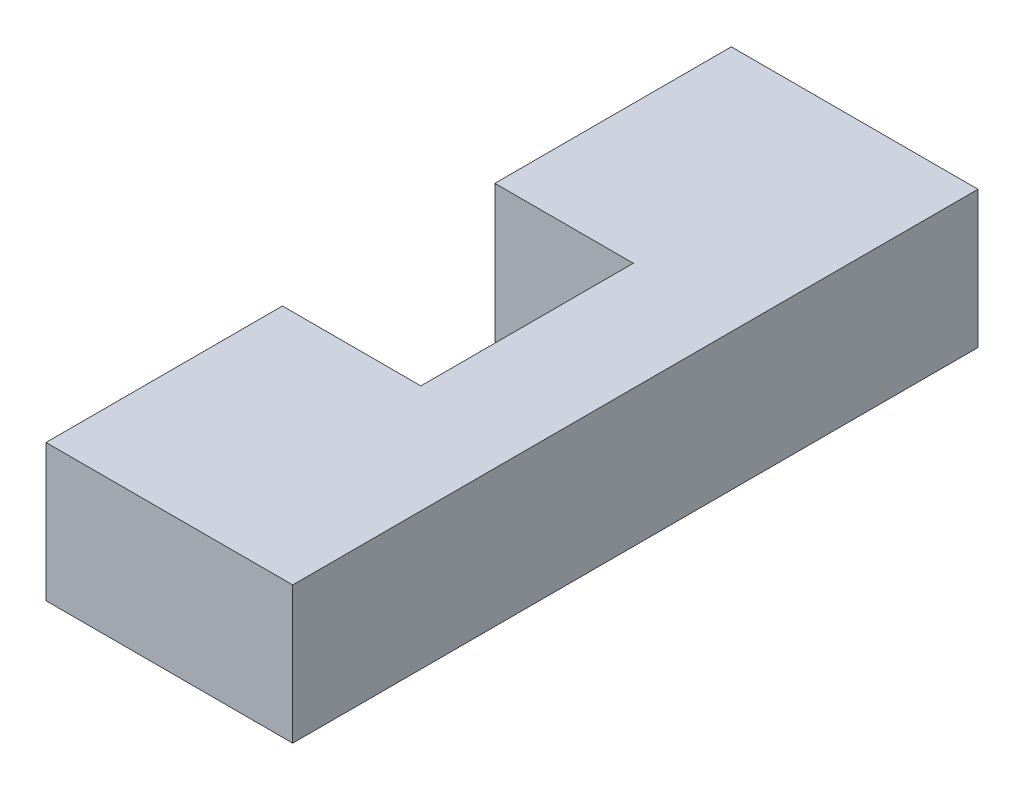
ISO-10303-21;
HEADER;
FILE_DESCRIPTION(('STEP AP214'),'2;1');
FILE_NAME('part.step','',(''),(''),'','','');
FILE_SCHEMA(('AUTOMOTIVE_DESIGN { 1 0 10303 214 1 1 1 1 }'));
ENDSEC;
DATA;
#1=APPLICATION_CONTEXT('core data for automotive mechanical design processes');
#2=APPLICATION_PROTOCOL_DEFINITION('international standard','automotive_design',2000,#1);
#3=PRODUCT_CONTEXT('',#1,'mechanical');
#4=PRODUCT('Part','Part','',(#3));
#5=PRODUCT_RELATED_PRODUCT_CATEGORY('part','',(#4));
#6=PRODUCT_DEFINITION_FORMATION('','',#4);
#7=PRODUCT_DEFINITION_CONTEXT('part definition',#1,'design');
#8=PRODUCT_DEFINITION('design','',#6,#7);
#9=PRODUCT_DEFINITION_SHAPE('','',#8);
#10=(LENGTH_UNIT() NAMED_UNIT(*) SI_UNIT(.MILLI.,.METRE.));
#11=(NAMED_UNIT(*) PLANE_ANGLE_UNIT() SI_UNIT($,.RADIAN.));
#12=(NAMED_UNIT(*) SI_UNIT($,.STERADIAN.) SOLID_ANGLE_UNIT());
#13=UNCERTAINTY_MEASURE_WITH_UNIT(LENGTH_MEASURE(1.E-05),#10,'distance_accuracy_value','');
#14=(GEOMETRIC_REPRESENTATION_CONTEXT(3) GLOBAL_UNCERTAINTY_ASSIGNED_CONTEXT((#13)) GLOBAL_UNIT_ASSIGNED_CONTEXT((#10,
#11,#12)) REPRESENTATION_CONTEXT('',''));
#15=CARTESIAN_POINT('',(0.,0.,0.));
#16=DIRECTION('',(0.,0.,1.));
#17=DIRECTION('',(1.,0.,0.));
#18=AXIS2_PLACEMENT_3D('',#15,#16,#17);
#19=CARTESIAN_POINT('',(-10.1,10.,-7.75));
#20=DIRECTION('',(0.,0.,1.));
#21=DIRECTION('',(-1.,0.,0.));
#22=AXIS2_PLACEMENT_3D('',#19,#20,#21);
#23=PLANE('',#22);
#24=DIRECTION('',(0.,1.,0.));
#25=VECTOR('',#24,1.);
#26=CARTESIAN_POINT('',(-10.,10.,-7.75));
#27=LINE('',#26,#25);
#28=CARTESIAN_POINT('',(-10.,0.,-7.75));
#29=VERTEX_POINT('',#28);
#30=CARTESIAN_POINT('',(-10.,10.,-7.75));
#31=VERTEX_POINT('',#30);
#32=EDGE_CURVE('E11',#29,#31,#27,.T.);
#33=ORIENTED_EDGE('',*,*,#32,.F.);
#34=DIRECTION('',(1.,0.,0.));
#35=VECTOR('',#34,1.);
#36=CARTESIAN_POINT('',(-16.,0.,-7.75));
#37=LINE('',#36,#35);
#38=CARTESIAN_POINT('',(0.0999999999999925,0.,-7.75));
#39=VERTEX_POINT('',#38);
#40=EDGE_CURVE('E104',#39,#29,#37,.F.);
#41=ORIENTED_EDGE('',*,*,#40,.F.);
#42=DIRECTION('',(0.,1.,0.));
#43=VECTOR('',#42,1.);
#44=CARTESIAN_POINT('',(0.0999999999999994,10.,-7.75));
#45=LINE('',#44,#43);
#46=CARTESIAN_POINT('',(0.0999999999999994,10.,-7.75));
#47=VERTEX_POINT('',#46);
#48=EDGE_CURVE('E46',#39,#47,#45,.T.);
#49=ORIENTED_EDGE('',*,*,#48,.T.);
#50=DIRECTION('',(-1.,0.,0.));
#51=VECTOR('',#50,1.);
#52=CARTESIAN_POINT('',(-10.1,10.,-7.75));
#53=LINE('',#52,#51);
#54=EDGE_CURVE('E142',#47,#31,#53,.T.);
#55=ORIENTED_EDGE('',*,*,#54,.T.);
#56=EDGE_LOOP('',(#33,#41,#49,#55));
#57=FACE_BOUND('',#56,.T.);
#58=ADVANCED_FACE('F37',(#57),#23,.T.);
#59=CARTESIAN_POINT('',(0.1,10.,7.75));
#60=DIRECTION('',(-1.,0.,0.));
#61=DIRECTION('',(0.,0.,-1.));
#62=AXIS2_PLACEMENT_3D('',#59,#60,#61);
#63=PLANE('',#62);
#64=ORIENTED_EDGE('',*,*,#48,.F.);
#65=DIRECTION('',(0.,0.,-1.));
#66=VECTOR('',#65,1.);
#67=CARTESIAN_POINT('',(0.0999999999999925,0.,25.));
#68=LINE('',#67,#66);
#69=CARTESIAN_POINT('',(0.0999999999999925,0.,7.75));
#70=VERTEX_POINT('',#69);
#71=EDGE_CURVE('E123',#70,#39,#68,.T.);
#72=ORIENTED_EDGE('',*,*,#71,.F.);
#73=DIRECTION('',(0.,1.,0.));
#74=VECTOR('',#73,1.);
#75=CARTESIAN_POINT('',(0.1,10.,7.75));
#76=LINE('',#75,#74);
#77=CARTESIAN_POINT('',(0.1,10.,7.75));
#78=VERTEX_POINT('',#77);
#79=EDGE_CURVE('E135',#70,#78,#76,.T.);
#80=ORIENTED_EDGE('',*,*,#79,.T.);
#81=DIRECTION('',(0.,0.,-1.));
#82=VECTOR('',#81,1.);
#83=CARTESIAN_POINT('',(0.1,10.,7.75));
#84=LINE('',#83,#82);
#85=EDGE_CURVE('E152',#78,#47,#84,.T.);
#86=ORIENTED_EDGE('',*,*,#85,.T.);
#87=EDGE_LOOP('',(#64,#72,#80,#86));
#88=FACE_BOUND('',#87,.T.);
#89=ADVANCED_FACE('F155',(#88),#63,.T.);
#90=CARTESIAN_POINT('',(-10.1,10.,7.75));
#91=DIRECTION('',(0.,0.,-1.));
#92=DIRECTION('',(1.,0.,0.));
#93=AXIS2_PLACEMENT_3D('',#90,#91,#92);
#94=PLANE('',#93);
#95=ORIENTED_EDGE('',*,*,#79,.F.);
#96=DIRECTION('',(1.,0.,0.));
#97=VECTOR('',#96,1.);
#98=CARTESIAN_POINT('',(-16.,0.,7.75));
#99=LINE('',#98,#97);
#100=CARTESIAN_POINT('',(-9.99999999999999,0.,7.75));
#101=VERTEX_POINT('',#100);
#102=EDGE_CURVE('E120',#101,#70,#99,.T.);
#103=ORIENTED_EDGE('',*,*,#102,.F.);
#104=DIRECTION('',(0.,1.,0.));
#105=VECTOR('',#104,1.);
#106=CARTESIAN_POINT('',(-9.99999999999999,10.,7.75));
#107=LINE('',#106,#105);
#108=CARTESIAN_POINT('',(-9.99999999999999,10.,7.75));
#109=VERTEX_POINT('',#108);
#110=EDGE_CURVE('E132',#101,#109,#107,.T.);
#111=ORIENTED_EDGE('',*,*,#110,.T.);
#112=DIRECTION('',(1.,0.,0.));
#113=VECTOR('',#112,1.);
#114=CARTESIAN_POINT('',(-10.1,10.,7.75));
#115=LINE('',#114,#113);
#116=EDGE_CURVE('E156',#109,#78,#115,.T.);
#117=ORIENTED_EDGE('',*,*,#116,.T.);
#118=EDGE_LOOP('',(#95,#103,#111,#117));
#119=FACE_BOUND('',#118,.T.);
#120=ADVANCED_FACE('F179',(#119),#94,.T.);
#121=CARTESIAN_POINT('',(-10.,10.,-25.));
#122=DIRECTION('',(-1.,0.,0.));
#123=DIRECTION('',(0.,0.,-1.));
#124=AXIS2_PLACEMENT_3D('',#121,#122,#123);
#125=PLANE('',#124);
#126=ORIENTED_EDGE('',*,*,#110,.F.);
#127=DIRECTION('',(0.,0.,-1.));
#128=VECTOR('',#127,1.);
#129=CARTESIAN_POINT('',(-9.99999999999999,0.,25.));
#130=LINE('',#129,#128);
#131=CARTESIAN_POINT('',(-9.99999999999999,0.,25.));
#132=VERTEX_POINT('',#131);
#133=EDGE_CURVE('E117',#132,#101,#130,.T.);
#134=ORIENTED_EDGE('',*,*,#133,.F.);
#135=DIRECTION('',(0.,1.,0.));
#136=VECTOR('',#135,1.);
#137=CARTESIAN_POINT('',(-9.99999999999999,10.,25.));
#138=LINE('',#137,#136);
#139=CARTESIAN_POINT('',(-9.99999999999999,10.,25.));
#140=VERTEX_POINT('',#139);
#141=EDGE_CURVE('E129',#132,#140,#138,.T.);
#142=ORIENTED_EDGE('',*,*,#141,.T.);
#143=DIRECTION('',(0.,0.,-1.));
#144=VECTOR('',#143,1.);
#145=CARTESIAN_POINT('',(-10.,10.,-25.));
#146=LINE('',#145,#144);
#147=EDGE_CURVE('E158',#140,#109,#146,.T.);
#148=ORIENTED_EDGE('',*,*,#147,.T.);
#149=EDGE_LOOP('',(#126,#134,#142,#148));
#150=FACE_BOUND('',#149,.T.);
#151=ADVANCED_FACE('F176',(#150),#125,.T.);
#152=CARTESIAN_POINT('',(-16.,10.,25.));
#153=DIRECTION('',(0.,0.,1.));
#154=DIRECTION('',(-1.,0.,0.));
#155=AXIS2_PLACEMENT_3D('',#152,#153,#154);
#156=PLANE('',#155);
#157=ORIENTED_EDGE('',*,*,#141,.F.);
#158=DIRECTION('',(1.,0.,0.));
#159=VECTOR('',#158,1.);
#160=CARTESIAN_POINT('',(-16.,0.,25.));
#161=LINE('',#160,#159);
#162=CARTESIAN_POINT('',(8.,0.,25.));
#163=VERTEX_POINT('',#162);
#164=EDGE_CURVE('E114',#163,#132,#161,.F.);
#165=ORIENTED_EDGE('',*,*,#164,.F.);
#166=DIRECTION('',(0.,1.,0.));
#167=VECTOR('',#166,1.);
#168=CARTESIAN_POINT('',(8.00000000000001,10.,25.));
#169=LINE('',#168,#167);
#170=CARTESIAN_POINT('',(8.00000000000001,10.,25.));
#171=VERTEX_POINT('',#170);
#172=EDGE_CURVE('E127',#163,#171,#169,.T.);
#173=ORIENTED_EDGE('',*,*,#172,.T.);
#174=DIRECTION('',(-1.,0.,0.));
#175=VECTOR('',#174,1.);
#176=CARTESIAN_POINT('',(-16.,10.,25.));
#177=LINE('',#176,#175);
#178=EDGE_CURVE('E161',#171,#140,#177,.T.);
#179=ORIENTED_EDGE('',*,*,#178,.T.);
#180=EDGE_LOOP('',(#157,#165,#173,#179));
#181=FACE_BOUND('',#180,.T.);
#182=ADVANCED_FACE('F181',(#181),#156,.T.);
#183=CARTESIAN_POINT('',(8.00000000000001,10.,25.));
#184=DIRECTION('',(-1.,0.,0.));
#185=DIRECTION('',(0.,0.,-1.));
#186=AXIS2_PLACEMENT_3D('',#183,#184,#185);
#187=PLANE('',#186);
#188=ORIENTED_EDGE('',*,*,#172,.F.);
#189=DIRECTION('',(0.,0.,-1.));
#190=VECTOR('',#189,1.);
#191=CARTESIAN_POINT('',(8.,0.,25.));
#192=LINE('',#191,#190);
#193=CARTESIAN_POINT('',(8.,0.,-25.));
#194=VERTEX_POINT('',#193);
#195=EDGE_CURVE('E111',#163,#194,#192,.T.);
#196=ORIENTED_EDGE('',*,*,#195,.T.);
#197=DIRECTION('',(0.,1.,0.));
#198=VECTOR('',#197,1.);
#199=CARTESIAN_POINT('',(8.00000000000001,10.,-25.));
#200=LINE('',#199,#198);
#201=CARTESIAN_POINT('',(8.00000000000001,10.,-25.));
#202=VERTEX_POINT('',#201);
#203=EDGE_CURVE('E54',#194,#202,#200,.T.);
#204=ORIENTED_EDGE('',*,*,#203,.T.);
#205=DIRECTION('',(0.,0.,-1.));
#206=VECTOR('',#205,1.);
#207=CARTESIAN_POINT('',(8.00000000000001,10.,25.));
#208=LINE('',#207,#206);
#209=EDGE_CURVE('E97',#171,#202,#208,.T.);
#210=ORIENTED_EDGE('',*,*,#209,.F.);
#211=EDGE_LOOP('',(#188,#196,#204,#210));
#212=FACE_BOUND('',#211,.T.);
#213=ADVANCED_FACE('F182',(#212),#187,.F.);
#214=CARTESIAN_POINT('',(-16.,10.,-25.));
#215=DIRECTION('',(0.,0.,1.));
#216=DIRECTION('',(-1.,0.,0.));
#217=AXIS2_PLACEMENT_3D('',#214,#215,#216);
#218=PLANE('',#217);
#219=ORIENTED_EDGE('',*,*,#203,.F.);
#220=DIRECTION('',(1.,0.,0.));
#221=VECTOR('',#220,1.);
#222=CARTESIAN_POINT('',(-16.,0.,-25.));
#223=LINE('',#222,#221);
#224=CARTESIAN_POINT('',(-10.,0.,-25.));
#225=VERTEX_POINT('',#224);
#226=EDGE_CURVE('E102',#194,#225,#223,.F.);
#227=ORIENTED_EDGE('',*,*,#226,.T.);
#228=DIRECTION('',(0.,1.,0.));
#229=VECTOR('',#228,1.);
#230=CARTESIAN_POINT('',(-10.,10.,-25.));
#231=LINE('',#230,#229);
#232=CARTESIAN_POINT('',(-10.,10.,-25.));
#233=VERTEX_POINT('',#232);
#234=EDGE_CURVE('E40',#225,#233,#231,.T.);
#235=ORIENTED_EDGE('',*,*,#234,.T.);
#236=DIRECTION('',(-1.,0.,0.));
#237=VECTOR('',#236,1.);
#238=CARTESIAN_POINT('',(-16.,10.,-25.));
#239=LINE('',#238,#237);
#240=EDGE_CURVE('E113',#202,#233,#239,.T.);
#241=ORIENTED_EDGE('',*,*,#240,.F.);
#242=EDGE_LOOP('',(#219,#227,#235,#241));
#243=FACE_BOUND('',#242,.T.);
#244=ADVANCED_FACE('F106',(#243),#218,.F.);
#245=DIRECTION('',(0.,0.,-1.));
#246=VECTOR('',#245,1.);
#247=CARTESIAN_POINT('',(-10.,0.,25.));
#248=LINE('',#247,#246);
#249=EDGE_CURVE('E91',#29,#225,#248,.T.);
#250=ORIENTED_EDGE('',*,*,#249,.F.);
#251=ORIENTED_EDGE('',*,*,#32,.T.);
#252=EDGE_CURVE('E93',#31,#233,#146,.T.);
#253=ORIENTED_EDGE('',*,*,#252,.T.);
#254=ORIENTED_EDGE('',*,*,#234,.F.);
#255=EDGE_LOOP('',(#250,#251,#253,#254));
#256=FACE_BOUND('',#255,.T.);
#257=ADVANCED_FACE('F90',(#256),#125,.T.);
#258=CARTESIAN_POINT('',(-16.,10.,25.));
#259=DIRECTION('',(0.,-1.,0.));
#260=DIRECTION('',(0.,0.,-1.));
#261=AXIS2_PLACEMENT_3D('',#258,#259,#260);
#262=PLANE('',#261);
#263=ORIENTED_EDGE('',*,*,#240,.T.);
#264=ORIENTED_EDGE('',*,*,#252,.F.);
#265=ORIENTED_EDGE('',*,*,#54,.F.);
#266=ORIENTED_EDGE('',*,*,#85,.F.);
#267=ORIENTED_EDGE('',*,*,#116,.F.);
#268=ORIENTED_EDGE('',*,*,#147,.F.);
#269=ORIENTED_EDGE('',*,*,#178,.F.);
#270=ORIENTED_EDGE('',*,*,#209,.T.);
#271=EDGE_LOOP('',(#263,#264,#265,#266,#267,#268,#269,#270));
#272=FACE_BOUND('',#271,.T.);
#273=ADVANCED_FACE('F150',(#272),#262,.F.);
#274=CARTESIAN_POINT('',(-16.,0.,25.));
#275=DIRECTION('',(0.,-1.,0.));
#276=DIRECTION('',(0.,0.,-1.));
#277=AXIS2_PLACEMENT_3D('',#274,#275,#276);
#278=PLANE('',#277);
#279=ORIENTED_EDGE('',*,*,#226,.F.);
#280=ORIENTED_EDGE('',*,*,#195,.F.);
#281=ORIENTED_EDGE('',*,*,#164,.T.);
#282=ORIENTED_EDGE('',*,*,#133,.T.);
#283=ORIENTED_EDGE('',*,*,#102,.T.);
#284=ORIENTED_EDGE('',*,*,#71,.T.);
#285=ORIENTED_EDGE('',*,*,#40,.T.);
#286=ORIENTED_EDGE('',*,*,#249,.T.);
#287=EDGE_LOOP('',(#279,#280,#281,#282,#283,#284,#285,#286));
#288=FACE_BOUND('',#287,.T.);
#289=ADVANCED_FACE('F100',(#288),#278,.T.);
#290=CLOSED_SHELL('',(#58,#89,#120,#151,#182,#213,#244,#257,#273,#289));
#291=MANIFOLD_SOLID_BREP('B2',#290);
#292=ADVANCED_BREP_SHAPE_REPRESENTATION('',(#18,#291),#14);
#293=SHAPE_DEFINITION_REPRESENTATION(#9,#292);
ENDSEC;
END-ISO-10303-21;
